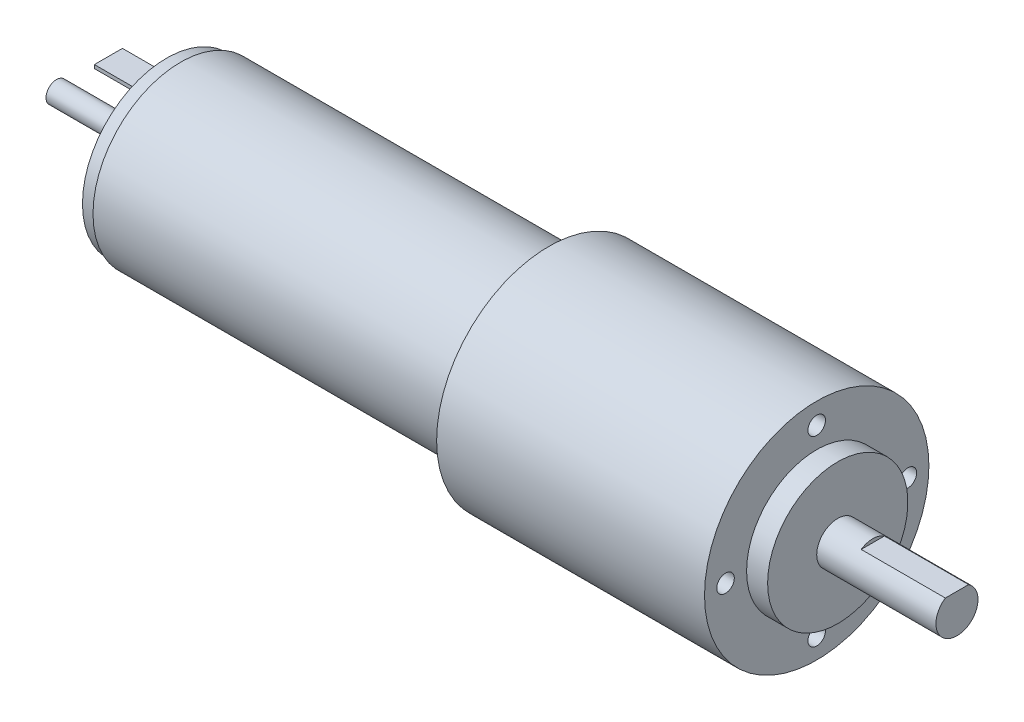
ISO-10303-21;
HEADER;
FILE_DESCRIPTION(('STEP AP214'),'2;1');
FILE_NAME('part.step','',(''),(''),'','','');
FILE_SCHEMA(('AUTOMOTIVE_DESIGN { 1 0 10303 214 1 1 1 1 }'));
ENDSEC;
DATA;
#1=APPLICATION_CONTEXT('core data for automotive mechanical design processes');
#2=APPLICATION_PROTOCOL_DEFINITION('international standard','automotive_design',2000,#1);
#3=PRODUCT_CONTEXT('',#1,'mechanical');
#4=PRODUCT('Part','Part','',(#3));
#5=PRODUCT_RELATED_PRODUCT_CATEGORY('part','',(#4));
#6=PRODUCT_DEFINITION_FORMATION('','',#4);
#7=PRODUCT_DEFINITION_CONTEXT('part definition',#1,'design');
#8=PRODUCT_DEFINITION('design','',#6,#7);
#9=PRODUCT_DEFINITION_SHAPE('','',#8);
#10=(LENGTH_UNIT() NAMED_UNIT(*) SI_UNIT(.MILLI.,.METRE.));
#11=(NAMED_UNIT(*) PLANE_ANGLE_UNIT() SI_UNIT($,.RADIAN.));
#12=(NAMED_UNIT(*) SI_UNIT($,.STERADIAN.) SOLID_ANGLE_UNIT());
#13=UNCERTAINTY_MEASURE_WITH_UNIT(LENGTH_MEASURE(1.E-05),#10,'distance_accuracy_value','');
#14=(GEOMETRIC_REPRESENTATION_CONTEXT(3) GLOBAL_UNCERTAINTY_ASSIGNED_CONTEXT((#13)) GLOBAL_UNIT_ASSIGNED_CONTEXT((#10,
#11,#12)) REPRESENTATION_CONTEXT('',''));
#15=CARTESIAN_POINT('',(0.,0.,0.));
#16=DIRECTION('',(0.,0.,1.));
#17=DIRECTION('',(1.,0.,0.));
#18=AXIS2_PLACEMENT_3D('',#15,#16,#17);
#19=CARTESIAN_POINT('',(15.7,-92.7855905862528,0.));
#20=DIRECTION('',(-1.,0.,0.));
#21=DIRECTION('',(0.,0.,1.));
#22=AXIS2_PLACEMENT_3D('',#19,#20,#21);
#23=PLANE('',#22);
#24=DIRECTION('',(0.,0.,1.));
#25=VECTOR('',#24,1.);
#26=CARTESIAN_POINT('',(15.7,-8.05,-1.99999999982625));
#27=LINE('',#26,#25);
#28=CARTESIAN_POINT('',(15.7,-8.05,-1.99999999982625));
#29=VERTEX_POINT('',#28);
#30=CARTESIAN_POINT('',(15.7,-8.05,2.00000000017375));
#31=VERTEX_POINT('',#30);
#32=EDGE_CURVE('E201',#29,#31,#27,.T.);
#33=ORIENTED_EDGE('',*,*,#32,.F.);
#34=DIRECTION('',(0.,-1.,0.));
#35=VECTOR('',#34,1.);
#36=CARTESIAN_POINT('',(15.7,-7.55,-1.99999999982625));
#37=LINE('',#36,#35);
#38=CARTESIAN_POINT('',(15.7,-7.55,-1.99999999982625));
#39=VERTEX_POINT('',#38);
#40=EDGE_CURVE('E185',#39,#29,#37,.T.);
#41=ORIENTED_EDGE('',*,*,#40,.F.);
#42=DIRECTION('',(0.,0.,1.));
#43=VECTOR('',#42,1.);
#44=CARTESIAN_POINT('',(15.7,-7.55,-1.99999999982625));
#45=LINE('',#44,#43);
#46=CARTESIAN_POINT('',(15.7,-7.55,2.00000000017375));
#47=VERTEX_POINT('',#46);
#48=EDGE_CURVE('E190',#39,#47,#45,.T.);
#49=ORIENTED_EDGE('',*,*,#48,.T.);
#50=DIRECTION('',(0.,-1.,0.));
#51=VECTOR('',#50,1.);
#52=CARTESIAN_POINT('',(15.7,-7.55,2.00000000017375));
#53=LINE('',#52,#51);
#54=EDGE_CURVE('E204',#47,#31,#53,.T.);
#55=ORIENTED_EDGE('',*,*,#54,.T.);
#56=EDGE_LOOP('',(#33,#41,#49,#55));
#57=FACE_BOUND('',#56,.T.);
#58=CARTESIAN_POINT('',(15.7,0.,0.));
#59=DIRECTION('',(-1.,0.,0.));
#60=DIRECTION('',(0.,0.,1.));
#61=AXIS2_PLACEMENT_3D('',#58,#59,#60);
#62=CIRCLE('',#61,12.);
#63=CARTESIAN_POINT('',(15.7,0.,12.));
#64=VERTEX_POINT('',#63);
#65=EDGE_CURVE('E224',#64,#64,#62,.T.);
#66=ORIENTED_EDGE('',*,*,#65,.T.);
#67=EDGE_LOOP('',(#66));
#68=FACE_BOUND('',#67,.T.);
#69=CARTESIAN_POINT('',(15.7,0.,0.));
#70=DIRECTION('',(-1.,0.,0.));
#71=DIRECTION('',(0.,0.,1.));
#72=AXIS2_PLACEMENT_3D('',#69,#70,#71);
#73=CIRCLE('',#72,1.5);
#74=CARTESIAN_POINT('',(15.7,0.,1.5));
#75=VERTEX_POINT('',#74);
#76=EDGE_CURVE('E221',#75,#75,#73,.T.);
#77=ORIENTED_EDGE('',*,*,#76,.F.);
#78=EDGE_LOOP('',(#77));
#79=FACE_BOUND('',#78,.T.);
#80=DIRECTION('',(0.,0.,-1.));
#81=VECTOR('',#80,1.);
#82=CARTESIAN_POINT('',(15.7,8.04999999999999,1.99999999982631));
#83=LINE('',#82,#81);
#84=CARTESIAN_POINT('',(15.7,8.04999999999999,1.99999999982631));
#85=VERTEX_POINT('',#84);
#86=CARTESIAN_POINT('',(15.7,8.05000000000001,-2.00000000017369));
#87=VERTEX_POINT('',#86);
#88=EDGE_CURVE('E48',#85,#87,#83,.T.);
#89=ORIENTED_EDGE('',*,*,#88,.F.);
#90=DIRECTION('',(0.,1.,0.));
#91=VECTOR('',#90,1.);
#92=CARTESIAN_POINT('',(15.7,7.54999999999999,1.9999999998263));
#93=LINE('',#92,#91);
#94=CARTESIAN_POINT('',(15.7,7.54999999999999,1.9999999998263));
#95=VERTEX_POINT('',#94);
#96=EDGE_CURVE('E155',#95,#85,#93,.T.);
#97=ORIENTED_EDGE('',*,*,#96,.F.);
#98=DIRECTION('',(0.,0.,-1.));
#99=VECTOR('',#98,1.);
#100=CARTESIAN_POINT('',(15.7,7.54999999999999,1.9999999998263));
#101=LINE('',#100,#99);
#102=CARTESIAN_POINT('',(15.7,7.55000000000001,-2.0000000001737));
#103=VERTEX_POINT('',#102);
#104=EDGE_CURVE('E162',#95,#103,#101,.T.);
#105=ORIENTED_EDGE('',*,*,#104,.T.);
#106=DIRECTION('',(0.,1.,0.));
#107=VECTOR('',#106,1.);
#108=CARTESIAN_POINT('',(15.7,7.55000000000001,-2.0000000001737));
#109=LINE('',#108,#107);
#110=EDGE_CURVE('E53',#103,#87,#109,.T.);
#111=ORIENTED_EDGE('',*,*,#110,.T.);
#112=EDGE_LOOP('',(#89,#97,#105,#111));
#113=FACE_BOUND('',#112,.T.);
#114=ADVANCED_FACE('F33',(#57,#68,#79,#113),#23,.T.);
#115=CARTESIAN_POINT('',(0.,-92.7855905862528,0.));
#116=DIRECTION('',(-1.,0.,0.));
#117=DIRECTION('',(0.,0.,1.));
#118=AXIS2_PLACEMENT_3D('',#115,#116,#117);
#119=PLANE('',#118);
#120=CARTESIAN_POINT('',(0.,0.,0.));
#121=DIRECTION('',(-1.,0.,0.));
#122=DIRECTION('',(0.,0.,1.));
#123=AXIS2_PLACEMENT_3D('',#120,#121,#122);
#124=CIRCLE('',#123,1.5);
#125=CARTESIAN_POINT('',(0.,0.,1.5));
#126=VERTEX_POINT('',#125);
#127=EDGE_CURVE('E218',#126,#126,#124,.T.);
#128=ORIENTED_EDGE('',*,*,#127,.T.);
#129=EDGE_LOOP('',(#128));
#130=FACE_BOUND('',#129,.T.);
#131=ADVANCED_FACE('F35',(#130),#119,.T.);
#132=CARTESIAN_POINT('',(128.4,-92.7855905862528,0.));
#133=DIRECTION('',(1.,0.,0.));
#134=DIRECTION('',(0.,0.,-1.));
#135=AXIS2_PLACEMENT_3D('',#132,#133,#134);
#136=PLANE('',#135);
#137=DIRECTION('',(0.,0.,1.));
#138=VECTOR('',#137,1.);
#139=CARTESIAN_POINT('',(128.4,2.5,-16.));
#140=LINE('',#139,#138);
#141=CARTESIAN_POINT('',(128.4,2.5,-1.65831239517794));
#142=VERTEX_POINT('',#141);
#143=CARTESIAN_POINT('',(128.4,2.5,1.65831239517794));
#144=VERTEX_POINT('',#143);
#145=EDGE_CURVE('E152',#142,#144,#140,.T.);
#146=ORIENTED_EDGE('',*,*,#145,.T.);
#147=CARTESIAN_POINT('',(128.4,0.,0.));
#148=DIRECTION('',(-1.,0.,0.));
#149=DIRECTION('',(0.,0.,1.));
#150=AXIS2_PLACEMENT_3D('',#147,#148,#149);
#151=CIRCLE('',#150,3.);
#152=EDGE_CURVE('E251',#142,#144,#151,.T.);
#153=ORIENTED_EDGE('',*,*,#152,.F.);
#154=EDGE_LOOP('',(#146,#153));
#155=FACE_BOUND('',#154,.T.);
#156=ADVANCED_FACE('F263',(#155),#136,.T.);
#157=CARTESIAN_POINT('',(-1000.,0.,0.));
#158=DIRECTION('',(-1.,0.,0.));
#159=DIRECTION('',(0.,0.,1.));
#160=AXIS2_PLACEMENT_3D('',#157,#158,#159);
#161=CYLINDRICAL_SURFACE('',#160,3.);
#162=DIRECTION('',(-1.,0.,0.));
#163=VECTOR('',#162,1.);
#164=CARTESIAN_POINT('',(-1000.,2.49999999999984,-1.65831239517794));
#165=LINE('',#164,#163);
#166=CARTESIAN_POINT('',(116.4,2.5,-1.6583123951777));
#167=VERTEX_POINT('',#166);
#168=EDGE_CURVE('E11',#142,#167,#165,.T.);
#169=ORIENTED_EDGE('',*,*,#168,.F.);
#170=ORIENTED_EDGE('',*,*,#152,.T.);
#171=DIRECTION('',(-1.,0.,0.));
#172=VECTOR('',#171,1.);
#173=CARTESIAN_POINT('',(-1000.,2.49999999999984,1.65831239517794));
#174=LINE('',#173,#172);
#175=CARTESIAN_POINT('',(116.4,2.5,1.6583123951777));
#176=VERTEX_POINT('',#175);
#177=EDGE_CURVE('E41',#176,#144,#174,.F.);
#178=ORIENTED_EDGE('',*,*,#177,.F.);
#179=CARTESIAN_POINT('',(116.4,0.,0.));
#180=DIRECTION('',(-1.,0.,0.));
#181=DIRECTION('',(0.,0.,1.));
#182=AXIS2_PLACEMENT_3D('',#179,#180,#181);
#183=CIRCLE('',#182,3.);
#184=EDGE_CURVE('E254',#167,#176,#183,.F.);
#185=ORIENTED_EDGE('',*,*,#184,.F.);
#186=EDGE_LOOP('',(#169,#170,#178,#185));
#187=FACE_BOUND('',#186,.T.);
#188=CARTESIAN_POINT('',(111.4,0.,0.));
#189=DIRECTION('',(-1.,0.,0.));
#190=DIRECTION('',(0.,0.,1.));
#191=AXIS2_PLACEMENT_3D('',#188,#189,#190);
#192=CIRCLE('',#191,3.);
#193=CARTESIAN_POINT('',(111.4,0.,3.));
#194=VERTEX_POINT('',#193);
#195=EDGE_CURVE('E248',#194,#194,#192,.T.);
#196=ORIENTED_EDGE('',*,*,#195,.F.);
#197=EDGE_LOOP('',(#196));
#198=FACE_BOUND('',#197,.T.);
#199=ADVANCED_FACE('F264',(#187,#198),#161,.T.);
#200=CARTESIAN_POINT('',(111.4,-92.7855905862528,0.));
#201=DIRECTION('',(1.,0.,0.));
#202=DIRECTION('',(0.,0.,-1.));
#203=AXIS2_PLACEMENT_3D('',#200,#201,#202);
#204=PLANE('',#203);
#205=ORIENTED_EDGE('',*,*,#195,.T.);
#206=EDGE_LOOP('',(#205));
#207=FACE_BOUND('',#206,.T.);
#208=CARTESIAN_POINT('',(111.4,0.,0.));
#209=DIRECTION('',(-1.,0.,0.));
#210=DIRECTION('',(0.,0.,1.));
#211=AXIS2_PLACEMENT_3D('',#208,#209,#210);
#212=CIRCLE('',#211,9.99999999999999);
#213=CARTESIAN_POINT('',(111.4,0.,9.99999999999999));
#214=VERTEX_POINT('',#213);
#215=EDGE_CURVE('E245',#214,#214,#212,.T.);
#216=ORIENTED_EDGE('',*,*,#215,.F.);
#217=EDGE_LOOP('',(#216));
#218=FACE_BOUND('',#217,.T.);
#219=ADVANCED_FACE('F320',(#207,#218),#204,.T.);
#220=CARTESIAN_POINT('',(-1000.,0.,0.));
#221=DIRECTION('',(-1.,0.,0.));
#222=DIRECTION('',(0.,0.,1.));
#223=AXIS2_PLACEMENT_3D('',#220,#221,#222);
#224=CYLINDRICAL_SURFACE('',#223,10.);
#225=ORIENTED_EDGE('',*,*,#215,.T.);
#226=EDGE_LOOP('',(#225));
#227=FACE_BOUND('',#226,.T.);
#228=CARTESIAN_POINT('',(108.4,0.,0.));
#229=DIRECTION('',(-1.,0.,0.));
#230=DIRECTION('',(0.,0.,1.));
#231=AXIS2_PLACEMENT_3D('',#228,#229,#230);
#232=CIRCLE('',#231,10.);
#233=CARTESIAN_POINT('',(108.4,0.,10.));
#234=VERTEX_POINT('',#233);
#235=EDGE_CURVE('E242',#234,#234,#232,.T.);
#236=ORIENTED_EDGE('',*,*,#235,.F.);
#237=EDGE_LOOP('',(#236));
#238=FACE_BOUND('',#237,.T.);
#239=ADVANCED_FACE('F316',(#227,#238),#224,.T.);
#240=CARTESIAN_POINT('',(108.4,-92.7855905862528,0.));
#241=DIRECTION('',(1.,0.,0.));
#242=DIRECTION('',(0.,0.,-1.));
#243=AXIS2_PLACEMENT_3D('',#240,#241,#242);
#244=PLANE('',#243);
#245=CARTESIAN_POINT('',(108.4,-4.08503553249798E-13,13.));
#246=DIRECTION('',(1.,0.,0.));
#247=DIRECTION('',(0.,0.,-1.));
#248=AXIS2_PLACEMENT_3D('',#245,#246,#247);
#249=CIRCLE('',#248,1.24999999999999);
#250=CARTESIAN_POINT('',(108.4,-4.08503553249798E-13,11.75));
#251=VERTEX_POINT('',#250);
#252=EDGE_CURVE('E128',#251,#251,#249,.T.);
#253=ORIENTED_EDGE('',*,*,#252,.F.);
#254=EDGE_LOOP('',(#253));
#255=FACE_BOUND('',#254,.T.);
#256=CARTESIAN_POINT('',(108.4,-13.,-2.72335702166532E-13));
#257=DIRECTION('',(1.,0.,0.));
#258=DIRECTION('',(0.,0.,-1.));
#259=AXIS2_PLACEMENT_3D('',#256,#257,#258);
#260=CIRCLE('',#259,1.24999999999999);
#261=CARTESIAN_POINT('',(108.4,-13.,-1.25000000000026));
#262=VERTEX_POINT('',#261);
#263=EDGE_CURVE('E136',#262,#262,#260,.T.);
#264=ORIENTED_EDGE('',*,*,#263,.F.);
#265=EDGE_LOOP('',(#264));
#266=FACE_BOUND('',#265,.T.);
#267=CARTESIAN_POINT('',(108.4,1.36167851083266E-13,-13.));
#268=DIRECTION('',(1.,0.,0.));
#269=DIRECTION('',(0.,0.,-1.));
#270=AXIS2_PLACEMENT_3D('',#267,#268,#269);
#271=CIRCLE('',#270,1.24999999999999);
#272=CARTESIAN_POINT('',(108.4,1.36167851083266E-13,-14.25));
#273=VERTEX_POINT('',#272);
#274=EDGE_CURVE('E142',#273,#273,#271,.T.);
#275=ORIENTED_EDGE('',*,*,#274,.F.);
#276=EDGE_LOOP('',(#275));
#277=FACE_BOUND('',#276,.T.);
#278=CARTESIAN_POINT('',(108.4,13.,0.));
#279=DIRECTION('',(1.,0.,0.));
#280=DIRECTION('',(0.,0.,-1.));
#281=AXIS2_PLACEMENT_3D('',#278,#279,#280);
#282=CIRCLE('',#281,1.24999999999999);
#283=CARTESIAN_POINT('',(108.4,13.,-1.24999999999999));
#284=VERTEX_POINT('',#283);
#285=EDGE_CURVE('E148',#284,#284,#282,.T.);
#286=ORIENTED_EDGE('',*,*,#285,.F.);
#287=EDGE_LOOP('',(#286));
#288=FACE_BOUND('',#287,.T.);
#289=ORIENTED_EDGE('',*,*,#235,.T.);
#290=EDGE_LOOP('',(#289));
#291=FACE_BOUND('',#290,.T.);
#292=CARTESIAN_POINT('',(108.4,0.,0.));
#293=DIRECTION('',(-1.,0.,0.));
#294=DIRECTION('',(0.,0.,1.));
#295=AXIS2_PLACEMENT_3D('',#292,#293,#294);
#296=CIRCLE('',#295,16.);
#297=CARTESIAN_POINT('',(108.4,0.,16.));
#298=VERTEX_POINT('',#297);
#299=EDGE_CURVE('E239',#298,#298,#296,.T.);
#300=ORIENTED_EDGE('',*,*,#299,.F.);
#301=EDGE_LOOP('',(#300));
#302=FACE_BOUND('',#301,.T.);
#303=ADVANCED_FACE('F312',(#255,#266,#277,#288,#291,#302),#244,.T.);
#304=CARTESIAN_POINT('',(-1000.,0.,0.));
#305=DIRECTION('',(-1.,0.,0.));
#306=DIRECTION('',(0.,0.,1.));
#307=AXIS2_PLACEMENT_3D('',#304,#305,#306);
#308=CYLINDRICAL_SURFACE('',#307,16.);
#309=ORIENTED_EDGE('',*,*,#299,.T.);
#310=EDGE_LOOP('',(#309));
#311=FACE_BOUND('',#310,.T.);
#312=CARTESIAN_POINT('',(70.2,0.,0.));
#313=DIRECTION('',(-1.,0.,0.));
#314=DIRECTION('',(0.,0.,1.));
#315=AXIS2_PLACEMENT_3D('',#312,#313,#314);
#316=CIRCLE('',#315,16.);
#317=CARTESIAN_POINT('',(70.2,0.,16.));
#318=VERTEX_POINT('',#317);
#319=EDGE_CURVE('E236',#318,#318,#316,.T.);
#320=ORIENTED_EDGE('',*,*,#319,.F.);
#321=EDGE_LOOP('',(#320));
#322=FACE_BOUND('',#321,.T.);
#323=ADVANCED_FACE('F308',(#311,#322),#308,.T.);
#324=CARTESIAN_POINT('',(70.2,-92.7855905862528,0.));
#325=DIRECTION('',(-1.,0.,0.));
#326=DIRECTION('',(0.,0.,1.));
#327=AXIS2_PLACEMENT_3D('',#324,#325,#326);
#328=PLANE('',#327);
#329=ORIENTED_EDGE('',*,*,#319,.T.);
#330=EDGE_LOOP('',(#329));
#331=FACE_BOUND('',#330,.T.);
#332=CARTESIAN_POINT('',(70.2,0.,0.));
#333=DIRECTION('',(-1.,0.,0.));
#334=DIRECTION('',(0.,0.,1.));
#335=AXIS2_PLACEMENT_3D('',#332,#333,#334);
#336=CIRCLE('',#335,12.5);
#337=CARTESIAN_POINT('',(70.2,0.,12.5));
#338=VERTEX_POINT('',#337);
#339=EDGE_CURVE('E233',#338,#338,#336,.T.);
#340=ORIENTED_EDGE('',*,*,#339,.F.);
#341=EDGE_LOOP('',(#340));
#342=FACE_BOUND('',#341,.T.);
#343=ADVANCED_FACE('F304',(#331,#342),#328,.T.);
#344=CARTESIAN_POINT('',(-1000.,0.,0.));
#345=DIRECTION('',(-1.,0.,0.));
#346=DIRECTION('',(0.,0.,1.));
#347=AXIS2_PLACEMENT_3D('',#344,#345,#346);
#348=CYLINDRICAL_SURFACE('',#347,12.5);
#349=ORIENTED_EDGE('',*,*,#339,.T.);
#350=EDGE_LOOP('',(#349));
#351=FACE_BOUND('',#350,.T.);
#352=CARTESIAN_POINT('',(17.7,0.,0.));
#353=DIRECTION('',(-1.,0.,0.));
#354=DIRECTION('',(0.,0.,1.));
#355=AXIS2_PLACEMENT_3D('',#352,#353,#354);
#356=CIRCLE('',#355,12.5);
#357=CARTESIAN_POINT('',(17.7,0.,12.5));
#358=VERTEX_POINT('',#357);
#359=EDGE_CURVE('E230',#358,#358,#356,.T.);
#360=ORIENTED_EDGE('',*,*,#359,.F.);
#361=EDGE_LOOP('',(#360));
#362=FACE_BOUND('',#361,.T.);
#363=ADVANCED_FACE('F300',(#351,#362),#348,.T.);
#364=CARTESIAN_POINT('',(17.7,-92.7855905862528,0.));
#365=DIRECTION('',(-1.,0.,0.));
#366=DIRECTION('',(0.,0.,1.));
#367=AXIS2_PLACEMENT_3D('',#364,#365,#366);
#368=PLANE('',#367);
#369=ORIENTED_EDGE('',*,*,#359,.T.);
#370=EDGE_LOOP('',(#369));
#371=FACE_BOUND('',#370,.T.);
#372=CARTESIAN_POINT('',(17.7,0.,0.));
#373=DIRECTION('',(-1.,0.,0.));
#374=DIRECTION('',(0.,0.,1.));
#375=AXIS2_PLACEMENT_3D('',#372,#373,#374);
#376=CIRCLE('',#375,12.);
#377=CARTESIAN_POINT('',(17.7,0.,12.));
#378=VERTEX_POINT('',#377);
#379=EDGE_CURVE('E227',#378,#378,#376,.T.);
#380=ORIENTED_EDGE('',*,*,#379,.F.);
#381=EDGE_LOOP('',(#380));
#382=FACE_BOUND('',#381,.T.);
#383=ADVANCED_FACE('F296',(#371,#382),#368,.T.);
#384=CARTESIAN_POINT('',(-1000.,0.,0.));
#385=DIRECTION('',(-1.,0.,0.));
#386=DIRECTION('',(0.,0.,1.));
#387=AXIS2_PLACEMENT_3D('',#384,#385,#386);
#388=CYLINDRICAL_SURFACE('',#387,12.);
#389=ORIENTED_EDGE('',*,*,#379,.T.);
#390=EDGE_LOOP('',(#389));
#391=FACE_BOUND('',#390,.T.);
#392=ORIENTED_EDGE('',*,*,#65,.F.);
#393=EDGE_LOOP('',(#392));
#394=FACE_BOUND('',#393,.T.);
#395=ADVANCED_FACE('F293',(#391,#394),#388,.T.);
#396=CARTESIAN_POINT('',(-1000.,0.,0.));
#397=DIRECTION('',(-1.,0.,0.));
#398=DIRECTION('',(0.,0.,1.));
#399=AXIS2_PLACEMENT_3D('',#396,#397,#398);
#400=CYLINDRICAL_SURFACE('',#399,1.5);
#401=ORIENTED_EDGE('',*,*,#76,.T.);
#402=EDGE_LOOP('',(#401));
#403=FACE_BOUND('',#402,.T.);
#404=ORIENTED_EDGE('',*,*,#127,.F.);
#405=EDGE_LOOP('',(#404));
#406=FACE_BOUND('',#405,.T.);
#407=ADVANCED_FACE('F291',(#403,#406),#400,.T.);
#408=CARTESIAN_POINT('',(7.4,-7.55,-1.99999999982625));
#409=DIRECTION('',(0.,0.,1.));
#410=DIRECTION('',(1.,0.,0.));
#411=AXIS2_PLACEMENT_3D('',#408,#409,#410);
#412=PLANE('',#411);
#413=ORIENTED_EDGE('',*,*,#40,.T.);
#414=DIRECTION('',(1.,0.,0.));
#415=VECTOR('',#414,1.);
#416=CARTESIAN_POINT('',(7.4,-8.05,-1.99999999982625));
#417=LINE('',#416,#415);
#418=CARTESIAN_POINT('',(7.4,-8.05,-1.99999999982625));
#419=VERTEX_POINT('',#418);
#420=EDGE_CURVE('E215',#419,#29,#417,.T.);
#421=ORIENTED_EDGE('',*,*,#420,.F.);
#422=DIRECTION('',(0.,-1.,0.));
#423=VECTOR('',#422,1.);
#424=CARTESIAN_POINT('',(7.4,-7.55,-1.99999999982625));
#425=LINE('',#424,#423);
#426=CARTESIAN_POINT('',(7.4,-7.55,-1.99999999982625));
#427=VERTEX_POINT('',#426);
#428=EDGE_CURVE('E186',#427,#419,#425,.T.);
#429=ORIENTED_EDGE('',*,*,#428,.F.);
#430=DIRECTION('',(1.,0.,0.));
#431=VECTOR('',#430,1.);
#432=CARTESIAN_POINT('',(7.4,-7.55,-1.99999999982625));
#433=LINE('',#432,#431);
#434=EDGE_CURVE('E198',#427,#39,#433,.T.);
#435=ORIENTED_EDGE('',*,*,#434,.T.);
#436=EDGE_LOOP('',(#413,#421,#429,#435));
#437=FACE_BOUND('',#436,.T.);
#438=ADVANCED_FACE('F377',(#437),#412,.F.);
#439=CARTESIAN_POINT('',(7.4,-8.05,-1.99999999982625));
#440=DIRECTION('',(0.,1.,0.));
#441=DIRECTION('',(0.,0.,1.));
#442=AXIS2_PLACEMENT_3D('',#439,#440,#441);
#443=PLANE('',#442);
#444=ORIENTED_EDGE('',*,*,#32,.T.);
#445=DIRECTION('',(1.,0.,0.));
#446=VECTOR('',#445,1.);
#447=CARTESIAN_POINT('',(7.4,-8.05,2.00000000017375));
#448=LINE('',#447,#446);
#449=CARTESIAN_POINT('',(7.4,-8.05,2.00000000017375));
#450=VERTEX_POINT('',#449);
#451=EDGE_CURVE('E212',#450,#31,#448,.T.);
#452=ORIENTED_EDGE('',*,*,#451,.F.);
#453=DIRECTION('',(0.,0.,1.));
#454=VECTOR('',#453,1.);
#455=CARTESIAN_POINT('',(7.4,-8.05,-1.99999999982625));
#456=LINE('',#455,#454);
#457=EDGE_CURVE('E189',#419,#450,#456,.T.);
#458=ORIENTED_EDGE('',*,*,#457,.F.);
#459=ORIENTED_EDGE('',*,*,#420,.T.);
#460=EDGE_LOOP('',(#444,#452,#458,#459));
#461=FACE_BOUND('',#460,.T.);
#462=ADVANCED_FACE('F384',(#461),#443,.F.);
#463=CARTESIAN_POINT('',(7.4,-7.55,2.00000000017375));
#464=DIRECTION('',(0.,0.,1.));
#465=DIRECTION('',(1.,0.,0.));
#466=AXIS2_PLACEMENT_3D('',#463,#464,#465);
#467=PLANE('',#466);
#468=ORIENTED_EDGE('',*,*,#54,.F.);
#469=DIRECTION('',(1.,0.,0.));
#470=VECTOR('',#469,1.);
#471=CARTESIAN_POINT('',(7.4,-7.55,2.00000000017375));
#472=LINE('',#471,#470);
#473=CARTESIAN_POINT('',(7.4,-7.55,2.00000000017375));
#474=VERTEX_POINT('',#473);
#475=EDGE_CURVE('E209',#474,#47,#472,.T.);
#476=ORIENTED_EDGE('',*,*,#475,.F.);
#477=DIRECTION('',(0.,-1.,0.));
#478=VECTOR('',#477,1.);
#479=CARTESIAN_POINT('',(7.4,-7.55,2.00000000017375));
#480=LINE('',#479,#478);
#481=EDGE_CURVE('E192',#474,#450,#480,.T.);
#482=ORIENTED_EDGE('',*,*,#481,.T.);
#483=ORIENTED_EDGE('',*,*,#451,.T.);
#484=EDGE_LOOP('',(#468,#476,#482,#483));
#485=FACE_BOUND('',#484,.T.);
#486=ADVANCED_FACE('F391',(#485),#467,.T.);
#487=CARTESIAN_POINT('',(7.4,-7.55,-1.99999999982625));
#488=DIRECTION('',(0.,1.,0.));
#489=DIRECTION('',(0.,0.,1.));
#490=AXIS2_PLACEMENT_3D('',#487,#488,#489);
#491=PLANE('',#490);
#492=ORIENTED_EDGE('',*,*,#48,.F.);
#493=ORIENTED_EDGE('',*,*,#434,.F.);
#494=DIRECTION('',(0.,0.,1.));
#495=VECTOR('',#494,1.);
#496=CARTESIAN_POINT('',(7.4,-7.55,-1.99999999982625));
#497=LINE('',#496,#495);
#498=EDGE_CURVE('E195',#427,#474,#497,.T.);
#499=ORIENTED_EDGE('',*,*,#498,.T.);
#500=ORIENTED_EDGE('',*,*,#475,.T.);
#501=EDGE_LOOP('',(#492,#493,#499,#500));
#502=FACE_BOUND('',#501,.T.);
#503=ADVANCED_FACE('F399',(#502),#491,.T.);
#504=CARTESIAN_POINT('',(7.4,-8.05,-1.99999999982625));
#505=DIRECTION('',(-1.,0.,0.));
#506=DIRECTION('',(0.,0.,1.));
#507=AXIS2_PLACEMENT_3D('',#504,#505,#506);
#508=PLANE('',#507);
#509=ORIENTED_EDGE('',*,*,#428,.T.);
#510=ORIENTED_EDGE('',*,*,#457,.T.);
#511=ORIENTED_EDGE('',*,*,#481,.F.);
#512=ORIENTED_EDGE('',*,*,#498,.F.);
#513=EDGE_LOOP('',(#509,#510,#511,#512));
#514=FACE_BOUND('',#513,.T.);
#515=ADVANCED_FACE('F407',(#514),#508,.T.);
#516=CARTESIAN_POINT('',(7.4,7.54999999999999,1.9999999998263));
#517=DIRECTION('',(0.,0.,-1.));
#518=DIRECTION('',(0.,1.,0.));
#519=AXIS2_PLACEMENT_3D('',#516,#517,#518);
#520=PLANE('',#519);
#521=ORIENTED_EDGE('',*,*,#96,.T.);
#522=DIRECTION('',(1.,0.,0.));
#523=VECTOR('',#522,1.);
#524=CARTESIAN_POINT('',(7.4,8.04999999999999,1.99999999982631));
#525=LINE('',#524,#523);
#526=CARTESIAN_POINT('',(7.4,8.04999999999999,1.99999999982631));
#527=VERTEX_POINT('',#526);
#528=EDGE_CURVE('E183',#527,#85,#525,.T.);
#529=ORIENTED_EDGE('',*,*,#528,.F.);
#530=DIRECTION('',(0.,1.,0.));
#531=VECTOR('',#530,1.);
#532=CARTESIAN_POINT('',(7.4,7.54999999999999,1.9999999998263));
#533=LINE('',#532,#531);
#534=CARTESIAN_POINT('',(7.4,7.54999999999999,1.9999999998263));
#535=VERTEX_POINT('',#534);
#536=EDGE_CURVE('E158',#535,#527,#533,.T.);
#537=ORIENTED_EDGE('',*,*,#536,.F.);
#538=DIRECTION('',(1.,0.,0.));
#539=VECTOR('',#538,1.);
#540=CARTESIAN_POINT('',(7.4,7.54999999999999,1.9999999998263));
#541=LINE('',#540,#539);
#542=EDGE_CURVE('E170',#535,#95,#541,.T.);
#543=ORIENTED_EDGE('',*,*,#542,.T.);
#544=EDGE_LOOP('',(#521,#529,#537,#543));
#545=FACE_BOUND('',#544,.T.);
#546=ADVANCED_FACE('F415',(#545),#520,.F.);
#547=CARTESIAN_POINT('',(7.4,8.04999999999999,1.99999999982631));
#548=DIRECTION('',(0.,-1.,0.));
#549=DIRECTION('',(0.,0.,-1.));
#550=AXIS2_PLACEMENT_3D('',#547,#548,#549);
#551=PLANE('',#550);
#552=ORIENTED_EDGE('',*,*,#88,.T.);
#553=DIRECTION('',(1.,0.,0.));
#554=VECTOR('',#553,1.);
#555=CARTESIAN_POINT('',(7.4,8.05000000000001,-2.00000000017369));
#556=LINE('',#555,#554);
#557=CARTESIAN_POINT('',(7.4,8.05000000000001,-2.00000000017369));
#558=VERTEX_POINT('',#557);
#559=EDGE_CURVE('E181',#558,#87,#556,.T.);
#560=ORIENTED_EDGE('',*,*,#559,.F.);
#561=DIRECTION('',(0.,0.,-1.));
#562=VECTOR('',#561,1.);
#563=CARTESIAN_POINT('',(7.4,8.04999999999999,1.99999999982631));
#564=LINE('',#563,#562);
#565=EDGE_CURVE('E161',#527,#558,#564,.T.);
#566=ORIENTED_EDGE('',*,*,#565,.F.);
#567=ORIENTED_EDGE('',*,*,#528,.T.);
#568=EDGE_LOOP('',(#552,#560,#566,#567));
#569=FACE_BOUND('',#568,.T.);
#570=ADVANCED_FACE('F423',(#569),#551,.F.);
#571=CARTESIAN_POINT('',(7.4,7.55000000000001,-2.0000000001737));
#572=DIRECTION('',(0.,0.,-1.));
#573=DIRECTION('',(0.,1.,0.));
#574=AXIS2_PLACEMENT_3D('',#571,#572,#573);
#575=PLANE('',#574);
#576=ORIENTED_EDGE('',*,*,#110,.F.);
#577=DIRECTION('',(1.,0.,0.));
#578=VECTOR('',#577,1.);
#579=CARTESIAN_POINT('',(7.4,7.55000000000001,-2.0000000001737));
#580=LINE('',#579,#578);
#581=CARTESIAN_POINT('',(7.4,7.55000000000001,-2.0000000001737));
#582=VERTEX_POINT('',#581);
#583=EDGE_CURVE('E178',#582,#103,#580,.T.);
#584=ORIENTED_EDGE('',*,*,#583,.F.);
#585=DIRECTION('',(0.,1.,0.));
#586=VECTOR('',#585,1.);
#587=CARTESIAN_POINT('',(7.4,7.55000000000001,-2.0000000001737));
#588=LINE('',#587,#586);
#589=EDGE_CURVE('E164',#582,#558,#588,.T.);
#590=ORIENTED_EDGE('',*,*,#589,.T.);
#591=ORIENTED_EDGE('',*,*,#559,.T.);
#592=EDGE_LOOP('',(#576,#584,#590,#591));
#593=FACE_BOUND('',#592,.T.);
#594=ADVANCED_FACE('F431',(#593),#575,.T.);
#595=CARTESIAN_POINT('',(7.4,7.54999999999999,1.9999999998263));
#596=DIRECTION('',(0.,-1.,0.));
#597=DIRECTION('',(0.,0.,-1.));
#598=AXIS2_PLACEMENT_3D('',#595,#596,#597);
#599=PLANE('',#598);
#600=ORIENTED_EDGE('',*,*,#104,.F.);
#601=ORIENTED_EDGE('',*,*,#542,.F.);
#602=DIRECTION('',(0.,0.,-1.));
#603=VECTOR('',#602,1.);
#604=CARTESIAN_POINT('',(7.4,7.54999999999999,1.9999999998263));
#605=LINE('',#604,#603);
#606=EDGE_CURVE('E167',#535,#582,#605,.T.);
#607=ORIENTED_EDGE('',*,*,#606,.T.);
#608=ORIENTED_EDGE('',*,*,#583,.T.);
#609=EDGE_LOOP('',(#600,#601,#607,#608));
#610=FACE_BOUND('',#609,.T.);
#611=ADVANCED_FACE('F439',(#610),#599,.T.);
#612=CARTESIAN_POINT('',(7.4,8.04999999999999,1.99999999982631));
#613=DIRECTION('',(-1.,0.,0.));
#614=DIRECTION('',(0.,0.,-1.));
#615=AXIS2_PLACEMENT_3D('',#612,#613,#614);
#616=PLANE('',#615);
#617=ORIENTED_EDGE('',*,*,#536,.T.);
#618=ORIENTED_EDGE('',*,*,#565,.T.);
#619=ORIENTED_EDGE('',*,*,#589,.F.);
#620=ORIENTED_EDGE('',*,*,#606,.F.);
#621=EDGE_LOOP('',(#617,#618,#619,#620));
#622=FACE_BOUND('',#621,.T.);
#623=ADVANCED_FACE('F278',(#622),#616,.T.);
#624=CARTESIAN_POINT('',(128.4,2.5,-16.));
#625=DIRECTION('',(0.,-1.,0.));
#626=DIRECTION('',(1.,0.,0.));
#627=AXIS2_PLACEMENT_3D('',#624,#625,#626);
#628=PLANE('',#627);
#629=ORIENTED_EDGE('',*,*,#177,.T.);
#630=ORIENTED_EDGE('',*,*,#145,.F.);
#631=ORIENTED_EDGE('',*,*,#168,.T.);
#632=DIRECTION('',(0.,0.,1.));
#633=VECTOR('',#632,1.);
#634=CARTESIAN_POINT('',(116.4,2.5,-16.));
#635=LINE('',#634,#633);
#636=EDGE_CURVE('E151',#167,#176,#635,.T.);
#637=ORIENTED_EDGE('',*,*,#636,.T.);
#638=EDGE_LOOP('',(#629,#630,#631,#637));
#639=FACE_BOUND('',#638,.T.);
#640=ADVANCED_FACE('F257',(#639),#628,.F.);
#641=CARTESIAN_POINT('',(116.4,3.,-16.));
#642=DIRECTION('',(-1.,0.,0.));
#643=DIRECTION('',(0.,0.,1.));
#644=AXIS2_PLACEMENT_3D('',#641,#642,#643);
#645=PLANE('',#644);
#646=ORIENTED_EDGE('',*,*,#636,.F.);
#647=ORIENTED_EDGE('',*,*,#184,.T.);
#648=EDGE_LOOP('',(#646,#647));
#649=FACE_BOUND('',#648,.T.);
#650=ADVANCED_FACE('F267',(#649),#645,.F.);
#651=CARTESIAN_POINT('',(108.4,13.,0.));
#652=DIRECTION('',(1.,0.,0.));
#653=DIRECTION('',(0.,0.,-1.));
#654=AXIS2_PLACEMENT_3D('',#651,#652,#653);
#655=CYLINDRICAL_SURFACE('',#654,1.24999999999999);
#656=CARTESIAN_POINT('',(101.9,13.,0.));
#657=DIRECTION('',(1.,0.,0.));
#658=DIRECTION('',(0.,0.,-1.));
#659=AXIS2_PLACEMENT_3D('',#656,#657,#658);
#660=CIRCLE('',#659,1.25);
#661=CARTESIAN_POINT('',(101.9,13.,-1.25));
#662=VERTEX_POINT('',#661);
#663=EDGE_CURVE('E145',#662,#662,#660,.T.);
#664=ORIENTED_EDGE('',*,*,#663,.F.);
#665=EDGE_LOOP('',(#664));
#666=FACE_BOUND('',#665,.T.);
#667=ORIENTED_EDGE('',*,*,#285,.T.);
#668=EDGE_LOOP('',(#667));
#669=FACE_BOUND('',#668,.T.);
#670=ADVANCED_FACE('F269',(#666,#669),#655,.F.);
#671=CARTESIAN_POINT('',(101.9,13.,0.));
#672=DIRECTION('',(1.,0.,0.));
#673=DIRECTION('',(0.,0.,-1.));
#674=AXIS2_PLACEMENT_3D('',#671,#672,#673);
#675=CONICAL_SURFACE('',#674,1.25,1.02974425867666);
#676=CARTESIAN_POINT('',(101.148924226216,13.,0.));
#677=VERTEX_POINT('',#676);
#678=VERTEX_LOOP('',#677);
#679=FACE_BOUND('',#678,.T.);
#680=ORIENTED_EDGE('',*,*,#663,.T.);
#681=EDGE_LOOP('',(#680));
#682=FACE_BOUND('',#681,.T.);
#683=ADVANCED_FACE('F275',(#679,#682),#675,.F.);
#684=CARTESIAN_POINT('',(108.4,1.36167851083266E-13,-13.));
#685=DIRECTION('',(1.,0.,0.));
#686=DIRECTION('',(0.,0.,-1.));
#687=AXIS2_PLACEMENT_3D('',#684,#685,#686);
#688=CYLINDRICAL_SURFACE('',#687,1.24999999999999);
#689=CARTESIAN_POINT('',(101.9,1.36167851083266E-13,-13.));
#690=DIRECTION('',(1.,0.,0.));
#691=DIRECTION('',(0.,0.,-1.));
#692=AXIS2_PLACEMENT_3D('',#689,#690,#691);
#693=CIRCLE('',#692,1.25);
#694=CARTESIAN_POINT('',(101.9,1.36167851083266E-13,-14.25));
#695=VERTEX_POINT('',#694);
#696=EDGE_CURVE('E139',#695,#695,#693,.T.);
#697=ORIENTED_EDGE('',*,*,#696,.F.);
#698=EDGE_LOOP('',(#697));
#699=FACE_BOUND('',#698,.T.);
#700=ORIENTED_EDGE('',*,*,#274,.T.);
#701=EDGE_LOOP('',(#700));
#702=FACE_BOUND('',#701,.T.);
#703=ADVANCED_FACE('F475',(#699,#702),#688,.F.);
#704=CARTESIAN_POINT('',(101.9,1.36167851083266E-13,-13.));
#705=DIRECTION('',(1.,0.,0.));
#706=DIRECTION('',(0.,0.,-1.));
#707=AXIS2_PLACEMENT_3D('',#704,#705,#706);
#708=CONICAL_SURFACE('',#707,1.25,1.02974425867666);
#709=CARTESIAN_POINT('',(101.148924226216,1.34391908390341E-13,-13.));
#710=VERTEX_POINT('',#709);
#711=VERTEX_LOOP('',#710);
#712=FACE_BOUND('',#711,.T.);
#713=ORIENTED_EDGE('',*,*,#696,.T.);
#714=EDGE_LOOP('',(#713));
#715=FACE_BOUND('',#714,.T.);
#716=ADVANCED_FACE('F486',(#712,#715),#708,.F.);
#717=CARTESIAN_POINT('',(108.4,-13.,-2.72335702166532E-13));
#718=DIRECTION('',(1.,0.,0.));
#719=DIRECTION('',(0.,0.,-1.));
#720=AXIS2_PLACEMENT_3D('',#717,#718,#719);
#721=CYLINDRICAL_SURFACE('',#720,1.24999999999999);
#722=CARTESIAN_POINT('',(101.9,-13.,-2.72335702166532E-13));
#723=DIRECTION('',(1.,0.,0.));
#724=DIRECTION('',(0.,0.,-1.));
#725=AXIS2_PLACEMENT_3D('',#722,#723,#724);
#726=CIRCLE('',#725,1.25);
#727=CARTESIAN_POINT('',(101.9,-13.,-1.25000000000027));
#728=VERTEX_POINT('',#727);
#729=EDGE_CURVE('E131',#728,#728,#726,.T.);
#730=ORIENTED_EDGE('',*,*,#729,.F.);
#731=EDGE_LOOP('',(#730));
#732=FACE_BOUND('',#731,.T.);
#733=ORIENTED_EDGE('',*,*,#263,.T.);
#734=EDGE_LOOP('',(#733));
#735=FACE_BOUND('',#734,.T.);
#736=ADVANCED_FACE('F494',(#732,#735),#721,.F.);
#737=CARTESIAN_POINT('',(101.9,-13.,-2.72335702166532E-13));
#738=DIRECTION('',(1.,0.,0.));
#739=DIRECTION('',(0.,0.,-1.));
#740=AXIS2_PLACEMENT_3D('',#737,#738,#739);
#741=CONICAL_SURFACE('',#740,1.25,1.02974425867666);
#742=CARTESIAN_POINT('',(101.148924226216,-13.,-2.72335702166532E-13));
#743=VERTEX_POINT('',#742);
#744=VERTEX_LOOP('',#743);
#745=FACE_BOUND('',#744,.T.);
#746=ORIENTED_EDGE('',*,*,#729,.T.);
#747=EDGE_LOOP('',(#746));
#748=FACE_BOUND('',#747,.T.);
#749=ADVANCED_FACE('F502',(#745,#748),#741,.F.);
#750=CARTESIAN_POINT('',(108.4,-4.08503553249798E-13,13.));
#751=DIRECTION('',(1.,0.,0.));
#752=DIRECTION('',(0.,0.,-1.));
#753=AXIS2_PLACEMENT_3D('',#750,#751,#752);
#754=CYLINDRICAL_SURFACE('',#753,1.24999999999999);
#755=CARTESIAN_POINT('',(101.9,-4.08503553249798E-13,13.));
#756=DIRECTION('',(1.,0.,0.));
#757=DIRECTION('',(0.,0.,-1.));
#758=AXIS2_PLACEMENT_3D('',#755,#756,#757);
#759=CIRCLE('',#758,1.25);
#760=CARTESIAN_POINT('',(101.9,-4.08503553249798E-13,11.75));
#761=VERTEX_POINT('',#760);
#762=EDGE_CURVE('E126',#761,#761,#759,.T.);
#763=ORIENTED_EDGE('',*,*,#762,.F.);
#764=EDGE_LOOP('',(#763));
#765=FACE_BOUND('',#764,.T.);
#766=ORIENTED_EDGE('',*,*,#252,.T.);
#767=EDGE_LOOP('',(#766));
#768=FACE_BOUND('',#767,.T.);
#769=ADVANCED_FACE('F122',(#765,#768),#754,.F.);
#770=CARTESIAN_POINT('',(101.9,-4.08503553249798E-13,13.));
#771=DIRECTION('',(1.,0.,0.));
#772=DIRECTION('',(0.,0.,-1.));
#773=AXIS2_PLACEMENT_3D('',#770,#771,#772);
#774=CONICAL_SURFACE('',#773,1.25,1.02974425867666);
#775=CARTESIAN_POINT('',(101.148924226216,-4.10279495942722E-13,13.));
#776=VERTEX_POINT('',#775);
#777=VERTEX_LOOP('',#776);
#778=FACE_BOUND('',#777,.T.);
#779=ORIENTED_EDGE('',*,*,#762,.T.);
#780=EDGE_LOOP('',(#779));
#781=FACE_BOUND('',#780,.T.);
#782=ADVANCED_FACE('F119',(#778,#781),#774,.F.);
#783=CLOSED_SHELL('',(#114,#131,#156,#199,#219,#239,#303,#323,#343,#363,#383,#395,#407,#438,
#462,#486,#503,#515,#546,#570,#594,#611,#623,#640,#650,#670,#683,#703,#716,#736,#749,#769,#782));
#784=MANIFOLD_SOLID_BREP('B2',#783);
#785=ADVANCED_BREP_SHAPE_REPRESENTATION('',(#18,#784),#14);
#786=SHAPE_DEFINITION_REPRESENTATION(#9,#785);
ENDSEC;
END-ISO-10303-21;
